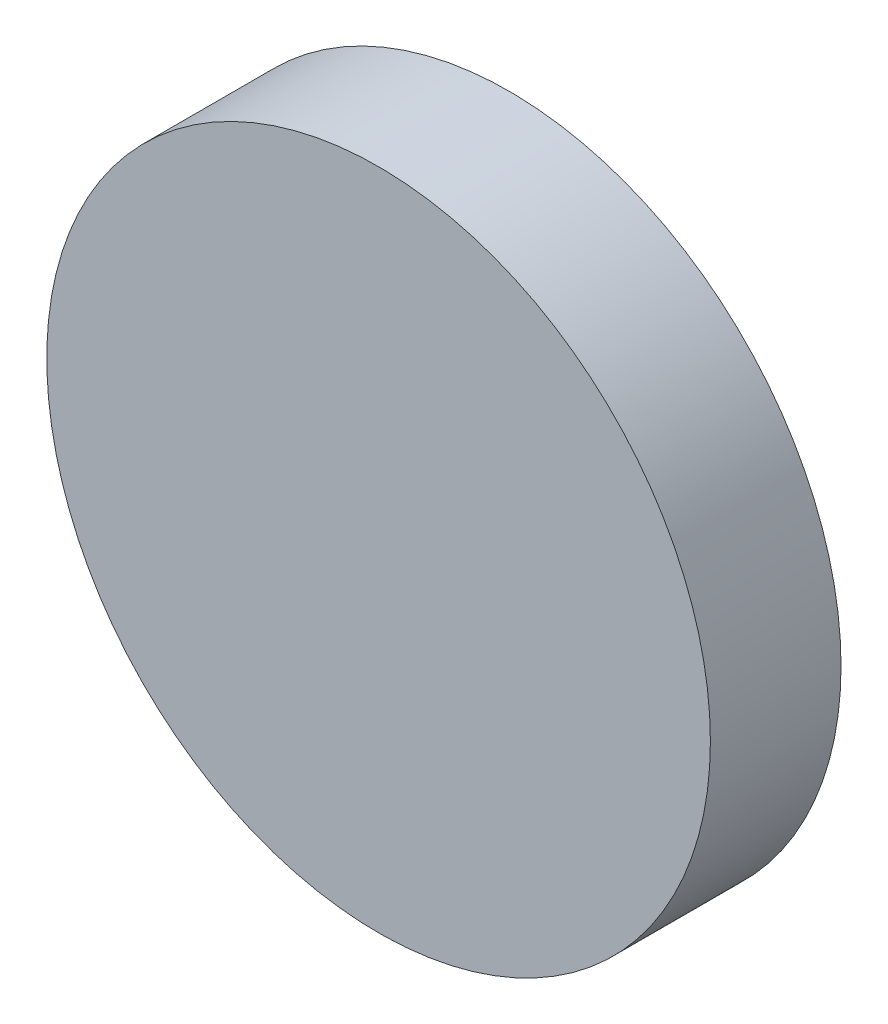
ISO-10303-21;
HEADER;
FILE_DESCRIPTION(('STEP AP214'),'2;1');
FILE_NAME('part.step','',(''),(''),'','','');
FILE_SCHEMA(('AUTOMOTIVE_DESIGN { 1 0 10303 214 1 1 1 1 }'));
ENDSEC;
DATA;
#1=APPLICATION_CONTEXT('core data for automotive mechanical design processes');
#2=APPLICATION_PROTOCOL_DEFINITION('international standard','automotive_design',2000,#1);
#3=PRODUCT_CONTEXT('',#1,'mechanical');
#4=PRODUCT('Part','Part','',(#3));
#5=PRODUCT_RELATED_PRODUCT_CATEGORY('part','',(#4));
#6=PRODUCT_DEFINITION_FORMATION('','',#4);
#7=PRODUCT_DEFINITION_CONTEXT('part definition',#1,'design');
#8=PRODUCT_DEFINITION('design','',#6,#7);
#9=PRODUCT_DEFINITION_SHAPE('','',#8);
#10=(LENGTH_UNIT() NAMED_UNIT(*) SI_UNIT(.MILLI.,.METRE.));
#11=(NAMED_UNIT(*) PLANE_ANGLE_UNIT() SI_UNIT($,.RADIAN.));
#12=(NAMED_UNIT(*) SI_UNIT($,.STERADIAN.) SOLID_ANGLE_UNIT());
#13=UNCERTAINTY_MEASURE_WITH_UNIT(LENGTH_MEASURE(1.E-05),#10,'distance_accuracy_value','');
#14=(GEOMETRIC_REPRESENTATION_CONTEXT(3) GLOBAL_UNCERTAINTY_ASSIGNED_CONTEXT((#13)) GLOBAL_UNIT_ASSIGNED_CONTEXT((#10,
#11,#12)) REPRESENTATION_CONTEXT('',''));
#15=CARTESIAN_POINT('',(0.,0.,0.));
#16=DIRECTION('',(0.,0.,1.));
#17=DIRECTION('',(1.,0.,0.));
#18=AXIS2_PLACEMENT_3D('',#15,#16,#17);
#19=CARTESIAN_POINT('',(0.,0.,7.874));
#20=DIRECTION('',(0.,0.,-1.));
#21=DIRECTION('',(-1.,0.,0.));
#22=AXIS2_PLACEMENT_3D('',#19,#20,#21);
#23=CYLINDRICAL_SURFACE('',#22,20.);
#24=CARTESIAN_POINT('',(0.,0.,7.874));
#25=DIRECTION('',(0.,0.,1.));
#26=DIRECTION('',(1.,0.,0.));
#27=AXIS2_PLACEMENT_3D('',#24,#25,#26);
#28=CIRCLE('',#27,20.);
#29=CARTESIAN_POINT('',(20.,0.,7.874));
#30=VERTEX_POINT('',#29);
#31=EDGE_CURVE('E10',#30,#30,#28,.T.);
#32=ORIENTED_EDGE('',*,*,#31,.F.);
#33=EDGE_LOOP('',(#32));
#34=FACE_BOUND('',#33,.T.);
#35=CARTESIAN_POINT('',(0.,0.,0.));
#36=DIRECTION('',(0.,0.,1.));
#37=DIRECTION('',(1.,0.,0.));
#38=AXIS2_PLACEMENT_3D('',#35,#36,#37);
#39=CIRCLE('',#38,20.);
#40=CARTESIAN_POINT('',(20.,0.,0.));
#41=VERTEX_POINT('',#40);
#42=EDGE_CURVE('E40',#41,#41,#39,.T.);
#43=ORIENTED_EDGE('',*,*,#42,.T.);
#44=EDGE_LOOP('',(#43));
#45=FACE_BOUND('',#44,.T.);
#46=ADVANCED_FACE('F37',(#34,#45),#23,.T.);
#47=CARTESIAN_POINT('',(0.,0.,7.874));
#48=DIRECTION('',(0.,0.,1.));
#49=DIRECTION('',(1.,0.,0.));
#50=AXIS2_PLACEMENT_3D('',#47,#48,#49);
#51=PLANE('',#50);
#52=ORIENTED_EDGE('',*,*,#31,.T.);
#53=EDGE_LOOP('',(#52));
#54=FACE_BOUND('',#53,.T.);
#55=ADVANCED_FACE('F52',(#54),#51,.T.);
#56=CARTESIAN_POINT('',(0.,0.,0.));
#57=DIRECTION('',(0.,0.,1.));
#58=DIRECTION('',(1.,0.,0.));
#59=AXIS2_PLACEMENT_3D('',#56,#57,#58);
#60=PLANE('',#59);
#61=ORIENTED_EDGE('',*,*,#42,.F.);
#62=EDGE_LOOP('',(#61));
#63=FACE_BOUND('',#62,.T.);
#64=ADVANCED_FACE('F50',(#63),#60,.F.);
#65=CLOSED_SHELL('',(#46,#55,#64));
#66=MANIFOLD_SOLID_BREP('B2',#65);
#67=ADVANCED_BREP_SHAPE_REPRESENTATION('',(#18,#66),#14);
#68=SHAPE_DEFINITION_REPRESENTATION(#9,#67);
ENDSEC;
END-ISO-10303-21;
